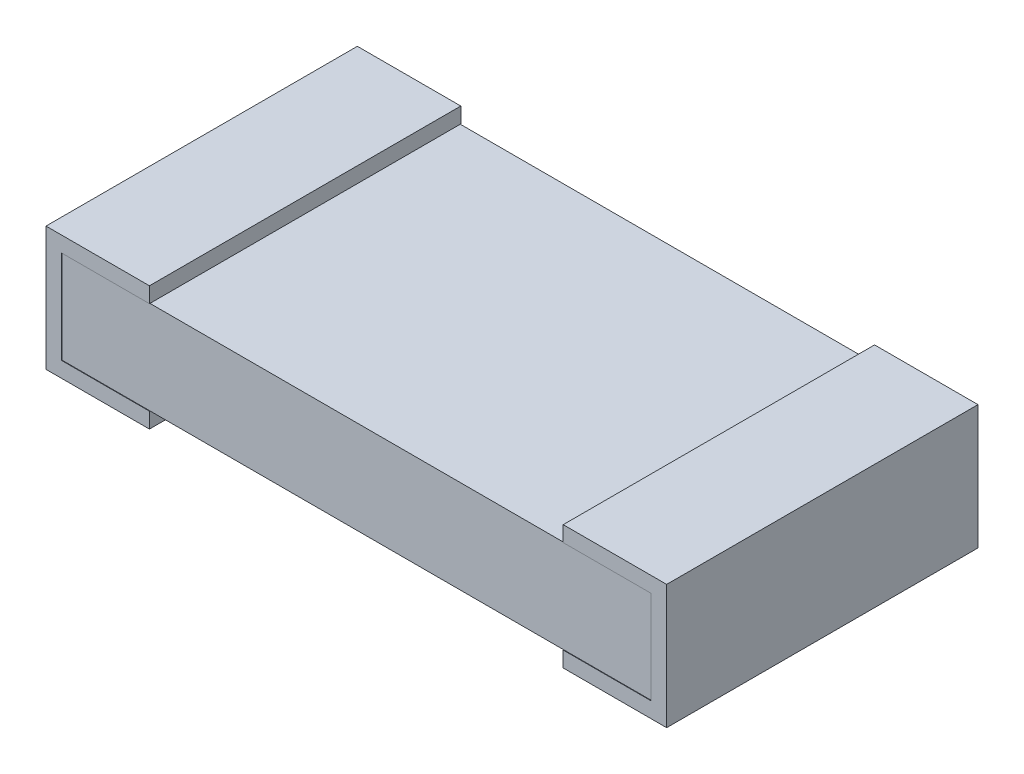
ISO-10303-21;
HEADER;
FILE_DESCRIPTION(('STEP AP214'),'2;1');
FILE_NAME('part.step','',(''),(''),'','','');
FILE_SCHEMA(('AUTOMOTIVE_DESIGN { 1 0 10303 214 1 1 1 1 }'));
ENDSEC;
DATA;
#1=APPLICATION_CONTEXT('core data for automotive mechanical design processes');
#2=APPLICATION_PROTOCOL_DEFINITION('international standard','automotive_design',2000,#1);
#3=PRODUCT_CONTEXT('',#1,'mechanical');
#4=PRODUCT('Part','Part','',(#3));
#5=PRODUCT_RELATED_PRODUCT_CATEGORY('part','',(#4));
#6=PRODUCT_DEFINITION_FORMATION('','',#4);
#7=PRODUCT_DEFINITION_CONTEXT('part definition',#1,'design');
#8=PRODUCT_DEFINITION('design','',#6,#7);
#9=PRODUCT_DEFINITION_SHAPE('','',#8);
#10=(LENGTH_UNIT() NAMED_UNIT(*) SI_UNIT(.MILLI.,.METRE.));
#11=(NAMED_UNIT(*) PLANE_ANGLE_UNIT() SI_UNIT($,.RADIAN.));
#12=(NAMED_UNIT(*) SI_UNIT($,.STERADIAN.) SOLID_ANGLE_UNIT());
#13=UNCERTAINTY_MEASURE_WITH_UNIT(LENGTH_MEASURE(1.E-05),#10,'distance_accuracy_value','');
#14=(GEOMETRIC_REPRESENTATION_CONTEXT(3) GLOBAL_UNCERTAINTY_ASSIGNED_CONTEXT((#13)) GLOBAL_UNIT_ASSIGNED_CONTEXT((#10,
#11,#12)) REPRESENTATION_CONTEXT('',''));
#15=CARTESIAN_POINT('',(0.,0.,0.));
#16=DIRECTION('',(0.,0.,1.));
#17=DIRECTION('',(1.,0.,0.));
#18=AXIS2_PLACEMENT_3D('',#15,#16,#17);
#19=CARTESIAN_POINT('',(2.9718,0.0762000000000004,-0.762));
#20=DIRECTION('',(0.,-1.,0.));
#21=DIRECTION('',(1.,0.,0.));
#22=AXIS2_PLACEMENT_3D('',#19,#20,#21);
#23=PLANE('',#22);
#24=DIRECTION('',(1.,0.,0.));
#25=VECTOR('',#24,1.);
#26=CARTESIAN_POINT('',(2.9718,0.0762000000000004,-0.762));
#27=LINE('',#26,#25);
#28=CARTESIAN_POINT('',(0.508,0.0762000000000001,-0.762));
#29=VERTEX_POINT('',#28);
#30=CARTESIAN_POINT('',(2.54,0.0762000000000001,-0.762));
#31=VERTEX_POINT('',#30);
#32=EDGE_CURVE('E40',#29,#31,#27,.T.);
#33=ORIENTED_EDGE('',*,*,#32,.T.);
#34=DIRECTION('',(0.,0.,-1.));
#35=VECTOR('',#34,1.);
#36=CARTESIAN_POINT('',(2.54,0.0762000000000001,0.76454));
#37=LINE('',#36,#35);
#38=CARTESIAN_POINT('',(2.54,0.0762000000000001,0.762));
#39=VERTEX_POINT('',#38);
#40=EDGE_CURVE('E271',#39,#31,#37,.T.);
#41=ORIENTED_EDGE('',*,*,#40,.F.);
#42=DIRECTION('',(1.,0.,0.));
#43=VECTOR('',#42,1.);
#44=CARTESIAN_POINT('',(2.9718,0.0762000000000004,0.762));
#45=LINE('',#44,#43);
#46=CARTESIAN_POINT('',(0.508,0.0762000000000001,0.762));
#47=VERTEX_POINT('',#46);
#48=EDGE_CURVE('E370',#47,#39,#45,.T.);
#49=ORIENTED_EDGE('',*,*,#48,.F.);
#50=DIRECTION('',(0.,0.,-1.));
#51=VECTOR('',#50,1.);
#52=CARTESIAN_POINT('',(0.508,0.0762000000000001,0.76454));
#53=LINE('',#52,#51);
#54=EDGE_CURVE('E332',#47,#29,#53,.T.);
#55=ORIENTED_EDGE('',*,*,#54,.T.);
#56=EDGE_LOOP('',(#33,#41,#49,#55));
#57=FACE_BOUND('',#56,.T.);
#58=ADVANCED_FACE('F31',(#57),#23,.T.);
#59=CARTESIAN_POINT('',(0.0762,0.5334,-0.762));
#60=DIRECTION('',(0.,1.,0.));
#61=DIRECTION('',(0.,0.,1.));
#62=AXIS2_PLACEMENT_3D('',#59,#60,#61);
#63=PLANE('',#62);
#64=DIRECTION('',(-1.,0.,0.));
#65=VECTOR('',#64,1.);
#66=CARTESIAN_POINT('',(0.0762,0.5334,0.762));
#67=LINE('',#66,#65);
#68=CARTESIAN_POINT('',(2.54,0.5334,0.762));
#69=VERTEX_POINT('',#68);
#70=CARTESIAN_POINT('',(0.508,0.5334,0.762));
#71=VERTEX_POINT('',#70);
#72=EDGE_CURVE('E363',#69,#71,#67,.T.);
#73=ORIENTED_EDGE('',*,*,#72,.F.);
#74=DIRECTION('',(0.,0.,-1.));
#75=VECTOR('',#74,1.);
#76=CARTESIAN_POINT('',(2.54,0.5334,0.76454));
#77=LINE('',#76,#75);
#78=CARTESIAN_POINT('',(2.54,0.5334,-0.762));
#79=VERTEX_POINT('',#78);
#80=EDGE_CURVE('E260',#69,#79,#77,.T.);
#81=ORIENTED_EDGE('',*,*,#80,.T.);
#82=DIRECTION('',(-1.,0.,0.));
#83=VECTOR('',#82,1.);
#84=CARTESIAN_POINT('',(0.0762,0.5334,-0.762));
#85=LINE('',#84,#83);
#86=CARTESIAN_POINT('',(0.508,0.5334,-0.762));
#87=VERTEX_POINT('',#86);
#88=EDGE_CURVE('E352',#79,#87,#85,.T.);
#89=ORIENTED_EDGE('',*,*,#88,.T.);
#90=DIRECTION('',(0.,0.,-1.));
#91=VECTOR('',#90,1.);
#92=CARTESIAN_POINT('',(0.508,0.5334,0.76454));
#93=LINE('',#92,#91);
#94=EDGE_CURVE('E343',#71,#87,#93,.T.);
#95=ORIENTED_EDGE('',*,*,#94,.F.);
#96=EDGE_LOOP('',(#73,#81,#89,#95));
#97=FACE_BOUND('',#96,.T.);
#98=ADVANCED_FACE('F33',(#97),#63,.T.);
#99=CARTESIAN_POINT('',(2.9718,0.5334,-0.762));
#100=DIRECTION('',(0.,0.,-1.));
#101=DIRECTION('',(-1.,0.,0.));
#102=AXIS2_PLACEMENT_3D('',#99,#100,#101);
#103=PLANE('',#102);
#104=DIRECTION('',(0.,1.,0.));
#105=VECTOR('',#104,1.);
#106=CARTESIAN_POINT('',(2.9718,0.0762000000000004,-0.762));
#107=LINE('',#106,#105);
#108=CARTESIAN_POINT('',(2.9718,0.0762,-0.762));
#109=VERTEX_POINT('',#108);
#110=CARTESIAN_POINT('',(2.9718,0.5334,-0.762));
#111=VERTEX_POINT('',#110);
#112=EDGE_CURVE('E350',#109,#111,#107,.T.);
#113=ORIENTED_EDGE('',*,*,#112,.F.);
#114=DIRECTION('',(-1.,0.,0.));
#115=VECTOR('',#114,1.);
#116=CARTESIAN_POINT('',(2.9718,0.0762,-0.762));
#117=LINE('',#116,#115);
#118=EDGE_CURVE('E253',#109,#31,#117,.T.);
#119=ORIENTED_EDGE('',*,*,#118,.T.);
#120=ORIENTED_EDGE('',*,*,#32,.F.);
#121=CARTESIAN_POINT('',(0.0762,0.0762,-0.762));
#122=VERTEX_POINT('',#121);
#123=EDGE_CURVE('E11',#122,#29,#27,.T.);
#124=ORIENTED_EDGE('',*,*,#123,.F.);
#125=DIRECTION('',(0.,-1.,0.));
#126=VECTOR('',#125,1.);
#127=CARTESIAN_POINT('',(0.0762,0.5334,-0.762));
#128=LINE('',#127,#126);
#129=CARTESIAN_POINT('',(0.0762,0.5334,-0.762));
#130=VERTEX_POINT('',#129);
#131=EDGE_CURVE('E355',#130,#122,#128,.T.);
#132=ORIENTED_EDGE('',*,*,#131,.F.);
#133=DIRECTION('',(-1.,0.,0.));
#134=VECTOR('',#133,1.);
#135=CARTESIAN_POINT('',(2.9718,0.5334,-0.762));
#136=LINE('',#135,#134);
#137=EDGE_CURVE('E326',#87,#130,#136,.T.);
#138=ORIENTED_EDGE('',*,*,#137,.F.);
#139=ORIENTED_EDGE('',*,*,#88,.F.);
#140=EDGE_CURVE('E353',#111,#79,#85,.T.);
#141=ORIENTED_EDGE('',*,*,#140,.F.);
#142=EDGE_LOOP('',(#113,#119,#120,#124,#132,#138,#139,#141));
#143=FACE_BOUND('',#142,.T.);
#144=ADVANCED_FACE('F434',(#143),#103,.T.);
#145=CARTESIAN_POINT('',(2.9718,0.5334,0.762));
#146=DIRECTION('',(0.,0.,-1.));
#147=DIRECTION('',(-1.,0.,0.));
#148=AXIS2_PLACEMENT_3D('',#145,#146,#147);
#149=PLANE('',#148);
#150=DIRECTION('',(0.,1.,0.));
#151=VECTOR('',#150,1.);
#152=CARTESIAN_POINT('',(2.9718,0.0762000000000004,0.762));
#153=LINE('',#152,#151);
#154=CARTESIAN_POINT('',(2.9718,0.0762000000000004,0.762));
#155=VERTEX_POINT('',#154);
#156=CARTESIAN_POINT('',(2.9718,0.5334,0.762));
#157=VERTEX_POINT('',#156);
#158=EDGE_CURVE('E349',#155,#157,#153,.T.);
#159=ORIENTED_EDGE('',*,*,#158,.T.);
#160=EDGE_CURVE('E360',#157,#69,#67,.T.);
#161=ORIENTED_EDGE('',*,*,#160,.T.);
#162=ORIENTED_EDGE('',*,*,#72,.T.);
#163=CARTESIAN_POINT('',(0.0762,0.5334,0.762));
#164=VERTEX_POINT('',#163);
#165=EDGE_CURVE('E359',#71,#164,#67,.T.);
#166=ORIENTED_EDGE('',*,*,#165,.T.);
#167=DIRECTION('',(0.,-1.,0.));
#168=VECTOR('',#167,1.);
#169=CARTESIAN_POINT('',(0.0762,0.5334,0.762));
#170=LINE('',#169,#168);
#171=CARTESIAN_POINT('',(0.0762,0.0762,0.762));
#172=VERTEX_POINT('',#171);
#173=EDGE_CURVE('E362',#164,#172,#170,.T.);
#174=ORIENTED_EDGE('',*,*,#173,.T.);
#175=EDGE_CURVE('E35',#172,#47,#45,.T.);
#176=ORIENTED_EDGE('',*,*,#175,.T.);
#177=ORIENTED_EDGE('',*,*,#48,.T.);
#178=EDGE_CURVE('E365',#39,#155,#45,.T.);
#179=ORIENTED_EDGE('',*,*,#178,.T.);
#180=EDGE_LOOP('',(#159,#161,#162,#166,#174,#176,#177,#179));
#181=FACE_BOUND('',#180,.T.);
#182=ADVANCED_FACE('F372',(#181),#149,.F.);
#183=CARTESIAN_POINT('',(0.0762,0.0762,0.76454));
#184=DIRECTION('',(0.,1.,0.));
#185=DIRECTION('',(-1.,0.,0.));
#186=AXIS2_PLACEMENT_3D('',#183,#184,#185);
#187=PLANE('',#186);
#188=ORIENTED_EDGE('',*,*,#175,.F.);
#189=DIRECTION('',(0.,0.,-1.));
#190=VECTOR('',#189,1.);
#191=CARTESIAN_POINT('',(0.0762,0.0762,0.76454));
#192=LINE('',#191,#190);
#193=CARTESIAN_POINT('',(0.0762,0.0762,0.76454));
#194=VERTEX_POINT('',#193);
#195=EDGE_CURVE('E334',#194,#172,#192,.T.);
#196=ORIENTED_EDGE('',*,*,#195,.F.);
#197=DIRECTION('',(1.,0.,0.));
#198=VECTOR('',#197,1.);
#199=CARTESIAN_POINT('',(0.0762,0.0762,0.76454));
#200=LINE('',#199,#198);
#201=CARTESIAN_POINT('',(0.508,0.0762000000000001,0.76454));
#202=VERTEX_POINT('',#201);
#203=EDGE_CURVE('E292',#194,#202,#200,.T.);
#204=ORIENTED_EDGE('',*,*,#203,.T.);
#205=EDGE_CURVE('E329',#202,#47,#53,.T.);
#206=ORIENTED_EDGE('',*,*,#205,.T.);
#207=EDGE_LOOP('',(#188,#196,#204,#206));
#208=FACE_BOUND('',#207,.T.);
#209=ADVANCED_FACE('F375',(#208),#187,.T.);
#210=CARTESIAN_POINT('',(0.0762,0.5334,0.76454));
#211=DIRECTION('',(1.,0.,0.));
#212=DIRECTION('',(0.,0.,-1.));
#213=AXIS2_PLACEMENT_3D('',#210,#211,#212);
#214=PLANE('',#213);
#215=ORIENTED_EDGE('',*,*,#173,.F.);
#216=DIRECTION('',(0.,0.,-1.));
#217=VECTOR('',#216,1.);
#218=CARTESIAN_POINT('',(0.0762,0.5334,0.76454));
#219=LINE('',#218,#217);
#220=CARTESIAN_POINT('',(0.0762,0.5334,0.76454));
#221=VERTEX_POINT('',#220);
#222=EDGE_CURVE('E56',#221,#164,#219,.T.);
#223=ORIENTED_EDGE('',*,*,#222,.F.);
#224=DIRECTION('',(0.,-1.,0.));
#225=VECTOR('',#224,1.);
#226=CARTESIAN_POINT('',(0.0762,0.5334,0.76454));
#227=LINE('',#226,#225);
#228=EDGE_CURVE('E289',#221,#194,#227,.T.);
#229=ORIENTED_EDGE('',*,*,#228,.T.);
#230=ORIENTED_EDGE('',*,*,#195,.T.);
#231=EDGE_LOOP('',(#215,#223,#229,#230));
#232=FACE_BOUND('',#231,.T.);
#233=ADVANCED_FACE('F378',(#232),#214,.T.);
#234=CARTESIAN_POINT('',(0.508,0.5334,0.76454));
#235=DIRECTION('',(0.,-1.,0.));
#236=DIRECTION('',(0.,0.,-1.));
#237=AXIS2_PLACEMENT_3D('',#234,#235,#236);
#238=PLANE('',#237);
#239=ORIENTED_EDGE('',*,*,#165,.F.);
#240=CARTESIAN_POINT('',(0.508,0.5334,0.76454));
#241=VERTEX_POINT('',#240);
#242=EDGE_CURVE('E340',#241,#71,#93,.T.);
#243=ORIENTED_EDGE('',*,*,#242,.F.);
#244=DIRECTION('',(-1.,0.,0.));
#245=VECTOR('',#244,1.);
#246=CARTESIAN_POINT('',(0.508,0.5334,0.76454));
#247=LINE('',#246,#245);
#248=EDGE_CURVE('E287',#241,#221,#247,.T.);
#249=ORIENTED_EDGE('',*,*,#248,.T.);
#250=ORIENTED_EDGE('',*,*,#222,.T.);
#251=EDGE_LOOP('',(#239,#243,#249,#250));
#252=FACE_BOUND('',#251,.T.);
#253=ADVANCED_FACE('F386',(#252),#238,.T.);
#254=CARTESIAN_POINT('',(0.,0.,0.76454));
#255=DIRECTION('',(-1.,0.,0.));
#256=DIRECTION('',(0.,0.,1.));
#257=AXIS2_PLACEMENT_3D('',#254,#255,#256);
#258=PLANE('',#257);
#259=DIRECTION('',(0.,1.,0.));
#260=VECTOR('',#259,1.);
#261=CARTESIAN_POINT('',(0.,0.,-0.76454));
#262=LINE('',#261,#260);
#263=CARTESIAN_POINT('',(0.,0.,-0.76454));
#264=VERTEX_POINT('',#263);
#265=CARTESIAN_POINT('',(0.,0.6096,-0.76454));
#266=VERTEX_POINT('',#265);
#267=EDGE_CURVE('E276',#264,#266,#262,.T.);
#268=ORIENTED_EDGE('',*,*,#267,.F.);
#269=DIRECTION('',(0.,0.,-1.));
#270=VECTOR('',#269,1.);
#271=CARTESIAN_POINT('',(0.,0.,0.76454));
#272=LINE('',#271,#270);
#273=CARTESIAN_POINT('',(0.,0.,0.76454));
#274=VERTEX_POINT('',#273);
#275=EDGE_CURVE('E324',#274,#264,#272,.T.);
#276=ORIENTED_EDGE('',*,*,#275,.F.);
#277=DIRECTION('',(0.,1.,0.));
#278=VECTOR('',#277,1.);
#279=CARTESIAN_POINT('',(0.,0.,0.76454));
#280=LINE('',#279,#278);
#281=CARTESIAN_POINT('',(0.,0.6096,0.76454));
#282=VERTEX_POINT('',#281);
#283=EDGE_CURVE('E277',#274,#282,#280,.T.);
#284=ORIENTED_EDGE('',*,*,#283,.T.);
#285=DIRECTION('',(0.,0.,-1.));
#286=VECTOR('',#285,1.);
#287=CARTESIAN_POINT('',(0.,0.6096,0.76454));
#288=LINE('',#287,#286);
#289=EDGE_CURVE('E301',#282,#266,#288,.T.);
#290=ORIENTED_EDGE('',*,*,#289,.T.);
#291=EDGE_LOOP('',(#268,#276,#284,#290));
#292=FACE_BOUND('',#291,.T.);
#293=ADVANCED_FACE('F412',(#292),#258,.T.);
#294=CARTESIAN_POINT('',(0.,0.,0.76454));
#295=DIRECTION('',(0.,-1.,0.));
#296=DIRECTION('',(1.,0.,0.));
#297=AXIS2_PLACEMENT_3D('',#294,#295,#296);
#298=PLANE('',#297);
#299=DIRECTION('',(-1.,0.,0.));
#300=VECTOR('',#299,1.);
#301=CARTESIAN_POINT('',(0.,0.,-0.76454));
#302=LINE('',#301,#300);
#303=CARTESIAN_POINT('',(0.508,0.,-0.76454));
#304=VERTEX_POINT('',#303);
#305=EDGE_CURVE('E281',#304,#264,#302,.T.);
#306=ORIENTED_EDGE('',*,*,#305,.F.);
#307=DIRECTION('',(0.,0.,-1.));
#308=VECTOR('',#307,1.);
#309=CARTESIAN_POINT('',(0.508,0.,0.76454));
#310=LINE('',#309,#308);
#311=CARTESIAN_POINT('',(0.508,0.,0.76454));
#312=VERTEX_POINT('',#311);
#313=EDGE_CURVE('E327',#312,#304,#310,.T.);
#314=ORIENTED_EDGE('',*,*,#313,.F.);
#315=DIRECTION('',(-1.,0.,0.));
#316=VECTOR('',#315,1.);
#317=CARTESIAN_POINT('',(0.,0.,0.76454));
#318=LINE('',#317,#316);
#319=EDGE_CURVE('E298',#312,#274,#318,.T.);
#320=ORIENTED_EDGE('',*,*,#319,.T.);
#321=ORIENTED_EDGE('',*,*,#275,.T.);
#322=EDGE_LOOP('',(#306,#314,#320,#321));
#323=FACE_BOUND('',#322,.T.);
#324=ADVANCED_FACE('F415',(#323),#298,.T.);
#325=CARTESIAN_POINT('',(0.508,0.,0.76454));
#326=DIRECTION('',(1.,0.,0.));
#327=DIRECTION('',(0.,0.,-1.));
#328=AXIS2_PLACEMENT_3D('',#325,#326,#327);
#329=PLANE('',#328);
#330=DIRECTION('',(0.,-1.,0.));
#331=VECTOR('',#330,1.);
#332=CARTESIAN_POINT('',(0.508,0.,-0.76454));
#333=LINE('',#332,#331);
#334=CARTESIAN_POINT('',(0.508,0.0762000000000001,-0.76454));
#335=VERTEX_POINT('',#334);
#336=EDGE_CURVE('E319',#335,#304,#333,.T.);
#337=ORIENTED_EDGE('',*,*,#336,.F.);
#338=EDGE_CURVE('E333',#29,#335,#53,.T.);
#339=ORIENTED_EDGE('',*,*,#338,.F.);
#340=ORIENTED_EDGE('',*,*,#54,.F.);
#341=ORIENTED_EDGE('',*,*,#205,.F.);
#342=DIRECTION('',(0.,-1.,0.));
#343=VECTOR('',#342,1.);
#344=CARTESIAN_POINT('',(0.508,0.,0.76454));
#345=LINE('',#344,#343);
#346=EDGE_CURVE('E295',#202,#312,#345,.T.);
#347=ORIENTED_EDGE('',*,*,#346,.T.);
#348=ORIENTED_EDGE('',*,*,#313,.T.);
#349=EDGE_LOOP('',(#337,#339,#340,#341,#347,#348));
#350=FACE_BOUND('',#349,.T.);
#351=ADVANCED_FACE('F418',(#350),#329,.T.);
#352=CARTESIAN_POINT('',(0.0762,0.0762,-0.76454));
#353=VERTEX_POINT('',#352);
#354=EDGE_CURVE('E337',#122,#353,#192,.T.);
#355=ORIENTED_EDGE('',*,*,#354,.F.);
#356=ORIENTED_EDGE('',*,*,#123,.T.);
#357=ORIENTED_EDGE('',*,*,#338,.T.);
#358=DIRECTION('',(1.,0.,0.));
#359=VECTOR('',#358,1.);
#360=CARTESIAN_POINT('',(0.0762,0.0762,-0.76454));
#361=LINE('',#360,#359);
#362=EDGE_CURVE('E316',#353,#335,#361,.T.);
#363=ORIENTED_EDGE('',*,*,#362,.F.);
#364=EDGE_LOOP('',(#355,#356,#357,#363));
#365=FACE_BOUND('',#364,.T.);
#366=ADVANCED_FACE('F427',(#365),#187,.T.);
#367=CARTESIAN_POINT('',(0.0762,0.5334,-0.76454));
#368=VERTEX_POINT('',#367);
#369=EDGE_CURVE('E339',#130,#368,#219,.T.);
#370=ORIENTED_EDGE('',*,*,#369,.F.);
#371=ORIENTED_EDGE('',*,*,#131,.T.);
#372=ORIENTED_EDGE('',*,*,#354,.T.);
#373=DIRECTION('',(0.,-1.,0.));
#374=VECTOR('',#373,1.);
#375=CARTESIAN_POINT('',(0.0762,0.5334,-0.76454));
#376=LINE('',#375,#374);
#377=EDGE_CURVE('E313',#368,#353,#376,.T.);
#378=ORIENTED_EDGE('',*,*,#377,.F.);
#379=EDGE_LOOP('',(#370,#371,#372,#378));
#380=FACE_BOUND('',#379,.T.);
#381=ADVANCED_FACE('F430',(#380),#214,.T.);
#382=CARTESIAN_POINT('',(0.508,0.5334,-0.76454));
#383=VERTEX_POINT('',#382);
#384=EDGE_CURVE('E344',#87,#383,#93,.T.);
#385=ORIENTED_EDGE('',*,*,#384,.F.);
#386=ORIENTED_EDGE('',*,*,#137,.T.);
#387=ORIENTED_EDGE('',*,*,#369,.T.);
#388=DIRECTION('',(-1.,0.,0.));
#389=VECTOR('',#388,1.);
#390=CARTESIAN_POINT('',(0.508,0.5334,-0.76454));
#391=LINE('',#390,#389);
#392=EDGE_CURVE('E310',#383,#368,#391,.T.);
#393=ORIENTED_EDGE('',*,*,#392,.F.);
#394=EDGE_LOOP('',(#385,#386,#387,#393));
#395=FACE_BOUND('',#394,.T.);
#396=ADVANCED_FACE('F400',(#395),#238,.T.);
#397=CARTESIAN_POINT('',(0.508,0.6096,0.76454));
#398=DIRECTION('',(1.,0.,0.));
#399=DIRECTION('',(0.,1.,0.));
#400=AXIS2_PLACEMENT_3D('',#397,#398,#399);
#401=PLANE('',#400);
#402=DIRECTION('',(0.,-1.,0.));
#403=VECTOR('',#402,1.);
#404=CARTESIAN_POINT('',(0.508,0.6096,-0.76454));
#405=LINE('',#404,#403);
#406=CARTESIAN_POINT('',(0.508,0.6096,-0.76454));
#407=VERTEX_POINT('',#406);
#408=EDGE_CURVE('E307',#407,#383,#405,.T.);
#409=ORIENTED_EDGE('',*,*,#408,.F.);
#410=DIRECTION('',(0.,0.,-1.));
#411=VECTOR('',#410,1.);
#412=CARTESIAN_POINT('',(0.508,0.6096,0.76454));
#413=LINE('',#412,#411);
#414=CARTESIAN_POINT('',(0.508,0.6096,0.76454));
#415=VERTEX_POINT('',#414);
#416=EDGE_CURVE('E345',#415,#407,#413,.T.);
#417=ORIENTED_EDGE('',*,*,#416,.F.);
#418=DIRECTION('',(0.,-1.,0.));
#419=VECTOR('',#418,1.);
#420=CARTESIAN_POINT('',(0.508,0.6096,0.76454));
#421=LINE('',#420,#419);
#422=EDGE_CURVE('E284',#415,#241,#421,.T.);
#423=ORIENTED_EDGE('',*,*,#422,.T.);
#424=ORIENTED_EDGE('',*,*,#242,.T.);
#425=ORIENTED_EDGE('',*,*,#94,.T.);
#426=ORIENTED_EDGE('',*,*,#384,.T.);
#427=EDGE_LOOP('',(#409,#417,#423,#424,#425,#426));
#428=FACE_BOUND('',#427,.T.);
#429=ADVANCED_FACE('F391',(#428),#401,.T.);
#430=CARTESIAN_POINT('',(0.,0.6096,0.76454));
#431=DIRECTION('',(0.,1.,0.));
#432=DIRECTION('',(0.,0.,1.));
#433=AXIS2_PLACEMENT_3D('',#430,#431,#432);
#434=PLANE('',#433);
#435=DIRECTION('',(1.,0.,0.));
#436=VECTOR('',#435,1.);
#437=CARTESIAN_POINT('',(0.,0.6096,-0.76454));
#438=LINE('',#437,#436);
#439=EDGE_CURVE('E304',#266,#407,#438,.T.);
#440=ORIENTED_EDGE('',*,*,#439,.F.);
#441=ORIENTED_EDGE('',*,*,#289,.F.);
#442=DIRECTION('',(1.,0.,0.));
#443=VECTOR('',#442,1.);
#444=CARTESIAN_POINT('',(0.,0.6096,0.76454));
#445=LINE('',#444,#443);
#446=EDGE_CURVE('E280',#282,#415,#445,.T.);
#447=ORIENTED_EDGE('',*,*,#446,.T.);
#448=ORIENTED_EDGE('',*,*,#416,.T.);
#449=EDGE_LOOP('',(#440,#441,#447,#448));
#450=FACE_BOUND('',#449,.T.);
#451=ADVANCED_FACE('F408',(#450),#434,.T.);
#452=CARTESIAN_POINT('',(0.,0.6096,0.76454));
#453=DIRECTION('',(0.,0.,-1.));
#454=DIRECTION('',(-1.,0.,0.));
#455=AXIS2_PLACEMENT_3D('',#452,#453,#454);
#456=PLANE('',#455);
#457=ORIENTED_EDGE('',*,*,#283,.F.);
#458=ORIENTED_EDGE('',*,*,#319,.F.);
#459=ORIENTED_EDGE('',*,*,#346,.F.);
#460=ORIENTED_EDGE('',*,*,#203,.F.);
#461=ORIENTED_EDGE('',*,*,#228,.F.);
#462=ORIENTED_EDGE('',*,*,#248,.F.);
#463=ORIENTED_EDGE('',*,*,#422,.F.);
#464=ORIENTED_EDGE('',*,*,#446,.F.);
#465=EDGE_LOOP('',(#457,#458,#459,#460,#461,#462,#463,#464));
#466=FACE_BOUND('',#465,.T.);
#467=ADVANCED_FACE('F383',(#466),#456,.F.);
#468=CARTESIAN_POINT('',(0.,0.6096,-0.76454));
#469=DIRECTION('',(0.,0.,-1.));
#470=DIRECTION('',(-1.,0.,0.));
#471=AXIS2_PLACEMENT_3D('',#468,#469,#470);
#472=PLANE('',#471);
#473=ORIENTED_EDGE('',*,*,#267,.T.);
#474=ORIENTED_EDGE('',*,*,#439,.T.);
#475=ORIENTED_EDGE('',*,*,#408,.T.);
#476=ORIENTED_EDGE('',*,*,#392,.T.);
#477=ORIENTED_EDGE('',*,*,#377,.T.);
#478=ORIENTED_EDGE('',*,*,#362,.T.);
#479=ORIENTED_EDGE('',*,*,#336,.T.);
#480=ORIENTED_EDGE('',*,*,#305,.T.);
#481=EDGE_LOOP('',(#473,#474,#475,#476,#477,#478,#479,#480));
#482=FACE_BOUND('',#481,.T.);
#483=ADVANCED_FACE('F404',(#482),#472,.T.);
#484=CARTESIAN_POINT('',(2.54,0.5334,0.76454));
#485=DIRECTION('',(0.,1.,0.));
#486=DIRECTION('',(0.,0.,1.));
#487=AXIS2_PLACEMENT_3D('',#484,#485,#486);
#488=PLANE('',#487);
#489=CARTESIAN_POINT('',(2.54,0.5334,0.76454));
#490=VERTEX_POINT('',#489);
#491=EDGE_CURVE('E257',#490,#69,#77,.T.);
#492=ORIENTED_EDGE('',*,*,#491,.T.);
#493=ORIENTED_EDGE('',*,*,#160,.F.);
#494=DIRECTION('',(0.,0.,-1.));
#495=VECTOR('',#494,1.);
#496=CARTESIAN_POINT('',(2.9718,0.5334,0.76454));
#497=LINE('',#496,#495);
#498=CARTESIAN_POINT('',(2.9718,0.5334,0.76454));
#499=VERTEX_POINT('',#498);
#500=EDGE_CURVE('E262',#499,#157,#497,.T.);
#501=ORIENTED_EDGE('',*,*,#500,.F.);
#502=DIRECTION('',(1.,0.,0.));
#503=VECTOR('',#502,1.);
#504=CARTESIAN_POINT('',(2.54,0.5334,0.76454));
#505=LINE('',#504,#503);
#506=EDGE_CURVE('E231',#490,#499,#505,.T.);
#507=ORIENTED_EDGE('',*,*,#506,.F.);
#508=EDGE_LOOP('',(#492,#493,#501,#507));
#509=FACE_BOUND('',#508,.T.);
#510=ADVANCED_FACE('F460',(#509),#488,.F.);
#511=CARTESIAN_POINT('',(2.9718,0.5334,0.76454));
#512=DIRECTION('',(1.,0.,0.));
#513=DIRECTION('',(0.,0.,-1.));
#514=AXIS2_PLACEMENT_3D('',#511,#512,#513);
#515=PLANE('',#514);
#516=ORIENTED_EDGE('',*,*,#500,.T.);
#517=ORIENTED_EDGE('',*,*,#158,.F.);
#518=DIRECTION('',(0.,0.,-1.));
#519=VECTOR('',#518,1.);
#520=CARTESIAN_POINT('',(2.9718,0.0762,0.76454));
#521=LINE('',#520,#519);
#522=CARTESIAN_POINT('',(2.9718,0.0762,0.76454));
#523=VERTEX_POINT('',#522);
#524=EDGE_CURVE('E48',#523,#155,#521,.T.);
#525=ORIENTED_EDGE('',*,*,#524,.F.);
#526=DIRECTION('',(0.,-1.,0.));
#527=VECTOR('',#526,1.);
#528=CARTESIAN_POINT('',(2.9718,0.5334,0.76454));
#529=LINE('',#528,#527);
#530=EDGE_CURVE('E229',#499,#523,#529,.T.);
#531=ORIENTED_EDGE('',*,*,#530,.F.);
#532=EDGE_LOOP('',(#516,#517,#525,#531));
#533=FACE_BOUND('',#532,.T.);
#534=ADVANCED_FACE('F463',(#533),#515,.F.);
#535=CARTESIAN_POINT('',(2.9718,0.0762,0.76454));
#536=DIRECTION('',(0.,-1.,0.));
#537=DIRECTION('',(1.,0.,0.));
#538=AXIS2_PLACEMENT_3D('',#535,#536,#537);
#539=PLANE('',#538);
#540=ORIENTED_EDGE('',*,*,#524,.T.);
#541=ORIENTED_EDGE('',*,*,#178,.F.);
#542=CARTESIAN_POINT('',(2.54,0.0762000000000001,0.76454));
#543=VERTEX_POINT('',#542);
#544=EDGE_CURVE('E268',#543,#39,#37,.T.);
#545=ORIENTED_EDGE('',*,*,#544,.F.);
#546=DIRECTION('',(-1.,0.,0.));
#547=VECTOR('',#546,1.);
#548=CARTESIAN_POINT('',(2.9718,0.0762,0.76454));
#549=LINE('',#548,#547);
#550=EDGE_CURVE('E227',#523,#543,#549,.T.);
#551=ORIENTED_EDGE('',*,*,#550,.F.);
#552=EDGE_LOOP('',(#540,#541,#545,#551));
#553=FACE_BOUND('',#552,.T.);
#554=ADVANCED_FACE('F465',(#553),#539,.F.);
#555=CARTESIAN_POINT('',(3.048,0.,0.76454));
#556=DIRECTION('',(-1.,0.,0.));
#557=DIRECTION('',(0.,0.,1.));
#558=AXIS2_PLACEMENT_3D('',#555,#556,#557);
#559=PLANE('',#558);
#560=DIRECTION('',(0.,1.,0.));
#561=VECTOR('',#560,1.);
#562=CARTESIAN_POINT('',(3.048,0.,-0.76454));
#563=LINE('',#562,#561);
#564=CARTESIAN_POINT('',(3.048,0.,-0.76454));
#565=VERTEX_POINT('',#564);
#566=CARTESIAN_POINT('',(3.048,0.6096,-0.76454));
#567=VERTEX_POINT('',#566);
#568=EDGE_CURVE('E236',#565,#567,#563,.T.);
#569=ORIENTED_EDGE('',*,*,#568,.T.);
#570=DIRECTION('',(0.,0.,-1.));
#571=VECTOR('',#570,1.);
#572=CARTESIAN_POINT('',(3.048,0.6096,0.76454));
#573=LINE('',#572,#571);
#574=CARTESIAN_POINT('',(3.048,0.6096,0.76454));
#575=VERTEX_POINT('',#574);
#576=EDGE_CURVE('E220',#575,#567,#573,.T.);
#577=ORIENTED_EDGE('',*,*,#576,.F.);
#578=DIRECTION('',(0.,1.,0.));
#579=VECTOR('',#578,1.);
#580=CARTESIAN_POINT('',(3.048,0.,0.76454));
#581=LINE('',#580,#579);
#582=CARTESIAN_POINT('',(3.048,0.,0.76454));
#583=VERTEX_POINT('',#582);
#584=EDGE_CURVE('E199',#583,#575,#581,.T.);
#585=ORIENTED_EDGE('',*,*,#584,.F.);
#586=DIRECTION('',(0.,0.,-1.));
#587=VECTOR('',#586,1.);
#588=CARTESIAN_POINT('',(3.048,0.,0.76454));
#589=LINE('',#588,#587);
#590=EDGE_CURVE('E208',#583,#565,#589,.T.);
#591=ORIENTED_EDGE('',*,*,#590,.T.);
#592=EDGE_LOOP('',(#569,#577,#585,#591));
#593=FACE_BOUND('',#592,.T.);
#594=ADVANCED_FACE('F218',(#593),#559,.F.);
#595=CARTESIAN_POINT('',(3.048,0.6096,0.76454));
#596=DIRECTION('',(0.,-1.,0.));
#597=DIRECTION('',(0.,0.,-1.));
#598=AXIS2_PLACEMENT_3D('',#595,#596,#597);
#599=PLANE('',#598);
#600=DIRECTION('',(-1.,0.,0.));
#601=VECTOR('',#600,1.);
#602=CARTESIAN_POINT('',(3.048,0.6096,-0.76454));
#603=LINE('',#602,#601);
#604=CARTESIAN_POINT('',(2.54,0.6096,-0.76454));
#605=VERTEX_POINT('',#604);
#606=EDGE_CURVE('E221',#567,#605,#603,.T.);
#607=ORIENTED_EDGE('',*,*,#606,.T.);
#608=DIRECTION('',(0.,0.,-1.));
#609=VECTOR('',#608,1.);
#610=CARTESIAN_POINT('',(2.54,0.6096,0.76454));
#611=LINE('',#610,#609);
#612=CARTESIAN_POINT('',(2.54,0.6096,0.76454));
#613=VERTEX_POINT('',#612);
#614=EDGE_CURVE('E254',#613,#605,#611,.T.);
#615=ORIENTED_EDGE('',*,*,#614,.F.);
#616=DIRECTION('',(-1.,0.,0.));
#617=VECTOR('',#616,1.);
#618=CARTESIAN_POINT('',(3.048,0.6096,0.76454));
#619=LINE('',#618,#617);
#620=EDGE_CURVE('E216',#575,#613,#619,.T.);
#621=ORIENTED_EDGE('',*,*,#620,.F.);
#622=ORIENTED_EDGE('',*,*,#576,.T.);
#623=EDGE_LOOP('',(#607,#615,#621,#622));
#624=FACE_BOUND('',#623,.T.);
#625=ADVANCED_FACE('F451',(#624),#599,.F.);
#626=CARTESIAN_POINT('',(2.54,0.6096,0.76454));
#627=DIRECTION('',(1.,0.,0.));
#628=DIRECTION('',(0.,1.,0.));
#629=AXIS2_PLACEMENT_3D('',#626,#627,#628);
#630=PLANE('',#629);
#631=DIRECTION('',(0.,-1.,0.));
#632=VECTOR('',#631,1.);
#633=CARTESIAN_POINT('',(2.54,0.6096,-0.76454));
#634=LINE('',#633,#632);
#635=CARTESIAN_POINT('',(2.54,0.5334,-0.76454));
#636=VERTEX_POINT('',#635);
#637=EDGE_CURVE('E223',#605,#636,#634,.T.);
#638=ORIENTED_EDGE('',*,*,#637,.T.);
#639=EDGE_CURVE('E261',#79,#636,#77,.T.);
#640=ORIENTED_EDGE('',*,*,#639,.F.);
#641=ORIENTED_EDGE('',*,*,#80,.F.);
#642=ORIENTED_EDGE('',*,*,#491,.F.);
#643=DIRECTION('',(0.,-1.,0.));
#644=VECTOR('',#643,1.);
#645=CARTESIAN_POINT('',(2.54,0.6096,0.76454));
#646=LINE('',#645,#644);
#647=EDGE_CURVE('E233',#613,#490,#646,.T.);
#648=ORIENTED_EDGE('',*,*,#647,.F.);
#649=ORIENTED_EDGE('',*,*,#614,.T.);
#650=EDGE_LOOP('',(#638,#640,#641,#642,#648,#649));
#651=FACE_BOUND('',#650,.T.);
#652=ADVANCED_FACE('F457',(#651),#630,.F.);
#653=ORIENTED_EDGE('',*,*,#140,.T.);
#654=ORIENTED_EDGE('',*,*,#639,.T.);
#655=DIRECTION('',(1.,0.,0.));
#656=VECTOR('',#655,1.);
#657=CARTESIAN_POINT('',(2.54,0.5334,-0.76454));
#658=LINE('',#657,#656);
#659=CARTESIAN_POINT('',(2.9718,0.5334,-0.76454));
#660=VERTEX_POINT('',#659);
#661=EDGE_CURVE('E247',#636,#660,#658,.T.);
#662=ORIENTED_EDGE('',*,*,#661,.T.);
#663=EDGE_CURVE('E265',#111,#660,#497,.T.);
#664=ORIENTED_EDGE('',*,*,#663,.F.);
#665=EDGE_LOOP('',(#653,#654,#662,#664));
#666=FACE_BOUND('',#665,.T.);
#667=ADVANCED_FACE('F548',(#666),#488,.F.);
#668=ORIENTED_EDGE('',*,*,#112,.T.);
#669=ORIENTED_EDGE('',*,*,#663,.T.);
#670=DIRECTION('',(0.,-1.,0.));
#671=VECTOR('',#670,1.);
#672=CARTESIAN_POINT('',(2.9718,0.5334,-0.76454));
#673=LINE('',#672,#671);
#674=CARTESIAN_POINT('',(2.9718,0.0762,-0.76454));
#675=VERTEX_POINT('',#674);
#676=EDGE_CURVE('E244',#660,#675,#673,.T.);
#677=ORIENTED_EDGE('',*,*,#676,.T.);
#678=EDGE_CURVE('E267',#109,#675,#521,.T.);
#679=ORIENTED_EDGE('',*,*,#678,.F.);
#680=EDGE_LOOP('',(#668,#669,#677,#679));
#681=FACE_BOUND('',#680,.T.);
#682=ADVANCED_FACE('F474',(#681),#515,.F.);
#683=ORIENTED_EDGE('',*,*,#118,.F.);
#684=ORIENTED_EDGE('',*,*,#678,.T.);
#685=DIRECTION('',(-1.,0.,0.));
#686=VECTOR('',#685,1.);
#687=CARTESIAN_POINT('',(2.9718,0.0762,-0.76454));
#688=LINE('',#687,#686);
#689=CARTESIAN_POINT('',(2.54,0.0762000000000001,-0.76454));
#690=VERTEX_POINT('',#689);
#691=EDGE_CURVE('E241',#675,#690,#688,.T.);
#692=ORIENTED_EDGE('',*,*,#691,.T.);
#693=EDGE_CURVE('E272',#31,#690,#37,.T.);
#694=ORIENTED_EDGE('',*,*,#693,.F.);
#695=EDGE_LOOP('',(#683,#684,#692,#694));
#696=FACE_BOUND('',#695,.T.);
#697=ADVANCED_FACE('F442',(#696),#539,.F.);
#698=CARTESIAN_POINT('',(2.54,0.,0.76454));
#699=DIRECTION('',(1.,0.,0.));
#700=DIRECTION('',(0.,0.,-1.));
#701=AXIS2_PLACEMENT_3D('',#698,#699,#700);
#702=PLANE('',#701);
#703=DIRECTION('',(0.,-1.,0.));
#704=VECTOR('',#703,1.);
#705=CARTESIAN_POINT('',(2.54,0.,-0.76454));
#706=LINE('',#705,#704);
#707=CARTESIAN_POINT('',(2.54,0.,-0.76454));
#708=VERTEX_POINT('',#707);
#709=EDGE_CURVE('E239',#690,#708,#706,.T.);
#710=ORIENTED_EDGE('',*,*,#709,.T.);
#711=DIRECTION('',(0.,0.,-1.));
#712=VECTOR('',#711,1.);
#713=CARTESIAN_POINT('',(2.54,0.,0.76454));
#714=LINE('',#713,#712);
#715=CARTESIAN_POINT('',(2.54,0.,0.76454));
#716=VERTEX_POINT('',#715);
#717=EDGE_CURVE('E215',#716,#708,#714,.T.);
#718=ORIENTED_EDGE('',*,*,#717,.F.);
#719=DIRECTION('',(0.,-1.,0.));
#720=VECTOR('',#719,1.);
#721=CARTESIAN_POINT('',(2.54,0.,0.76454));
#722=LINE('',#721,#720);
#723=EDGE_CURVE('E202',#543,#716,#722,.T.);
#724=ORIENTED_EDGE('',*,*,#723,.F.);
#725=ORIENTED_EDGE('',*,*,#544,.T.);
#726=ORIENTED_EDGE('',*,*,#40,.T.);
#727=ORIENTED_EDGE('',*,*,#693,.T.);
#728=EDGE_LOOP('',(#710,#718,#724,#725,#726,#727));
#729=FACE_BOUND('',#728,.T.);
#730=ADVANCED_FACE('F438',(#729),#702,.F.);
#731=CARTESIAN_POINT('',(3.048,0.,0.76454));
#732=DIRECTION('',(0.,1.,0.));
#733=DIRECTION('',(-1.,0.,0.));
#734=AXIS2_PLACEMENT_3D('',#731,#732,#733);
#735=PLANE('',#734);
#736=DIRECTION('',(1.,0.,0.));
#737=VECTOR('',#736,1.);
#738=CARTESIAN_POINT('',(3.048,0.,-0.76454));
#739=LINE('',#738,#737);
#740=EDGE_CURVE('E211',#708,#565,#739,.T.);
#741=ORIENTED_EDGE('',*,*,#740,.T.);
#742=ORIENTED_EDGE('',*,*,#590,.F.);
#743=DIRECTION('',(1.,0.,0.));
#744=VECTOR('',#743,1.);
#745=CARTESIAN_POINT('',(3.048,0.,0.76454));
#746=LINE('',#745,#744);
#747=EDGE_CURVE('E195',#716,#583,#746,.T.);
#748=ORIENTED_EDGE('',*,*,#747,.F.);
#749=ORIENTED_EDGE('',*,*,#717,.T.);
#750=EDGE_LOOP('',(#741,#742,#748,#749));
#751=FACE_BOUND('',#750,.T.);
#752=ADVANCED_FACE('F209',(#751),#735,.F.);
#753=CARTESIAN_POINT('',(3.048,0.6096,0.76454));
#754=DIRECTION('',(0.,0.,-1.));
#755=DIRECTION('',(1.,0.,0.));
#756=AXIS2_PLACEMENT_3D('',#753,#754,#755);
#757=PLANE('',#756);
#758=ORIENTED_EDGE('',*,*,#584,.T.);
#759=ORIENTED_EDGE('',*,*,#620,.T.);
#760=ORIENTED_EDGE('',*,*,#647,.T.);
#761=ORIENTED_EDGE('',*,*,#506,.T.);
#762=ORIENTED_EDGE('',*,*,#530,.T.);
#763=ORIENTED_EDGE('',*,*,#550,.T.);
#764=ORIENTED_EDGE('',*,*,#723,.T.);
#765=ORIENTED_EDGE('',*,*,#747,.T.);
#766=EDGE_LOOP('',(#758,#759,#760,#761,#762,#763,#764,#765));
#767=FACE_BOUND('',#766,.T.);
#768=ADVANCED_FACE('F197',(#767),#757,.F.);
#769=CARTESIAN_POINT('',(3.048,0.6096,-0.76454));
#770=DIRECTION('',(0.,0.,-1.));
#771=DIRECTION('',(1.,0.,0.));
#772=AXIS2_PLACEMENT_3D('',#769,#770,#771);
#773=PLANE('',#772);
#774=ORIENTED_EDGE('',*,*,#568,.F.);
#775=ORIENTED_EDGE('',*,*,#740,.F.);
#776=ORIENTED_EDGE('',*,*,#709,.F.);
#777=ORIENTED_EDGE('',*,*,#691,.F.);
#778=ORIENTED_EDGE('',*,*,#676,.F.);
#779=ORIENTED_EDGE('',*,*,#661,.F.);
#780=ORIENTED_EDGE('',*,*,#637,.F.);
#781=ORIENTED_EDGE('',*,*,#606,.F.);
#782=EDGE_LOOP('',(#774,#775,#776,#777,#778,#779,#780,#781));
#783=FACE_BOUND('',#782,.T.);
#784=ADVANCED_FACE('F446',(#783),#773,.T.);
#785=CLOSED_SHELL('',(#58,#98,#144,#182,#209,#233,#253,#293,#324,#351,#366,#381,#396,#429,#451,
#467,#483,#510,#534,#554,#594,#625,#652,#667,#682,#697,#730,#752,#768,#784));
#786=MANIFOLD_SOLID_BREP('B2',#785);
#787=ADVANCED_BREP_SHAPE_REPRESENTATION('',(#18,#786),#14);
#788=SHAPE_DEFINITION_REPRESENTATION(#9,#787);
ENDSEC;
END-ISO-10303-21;
